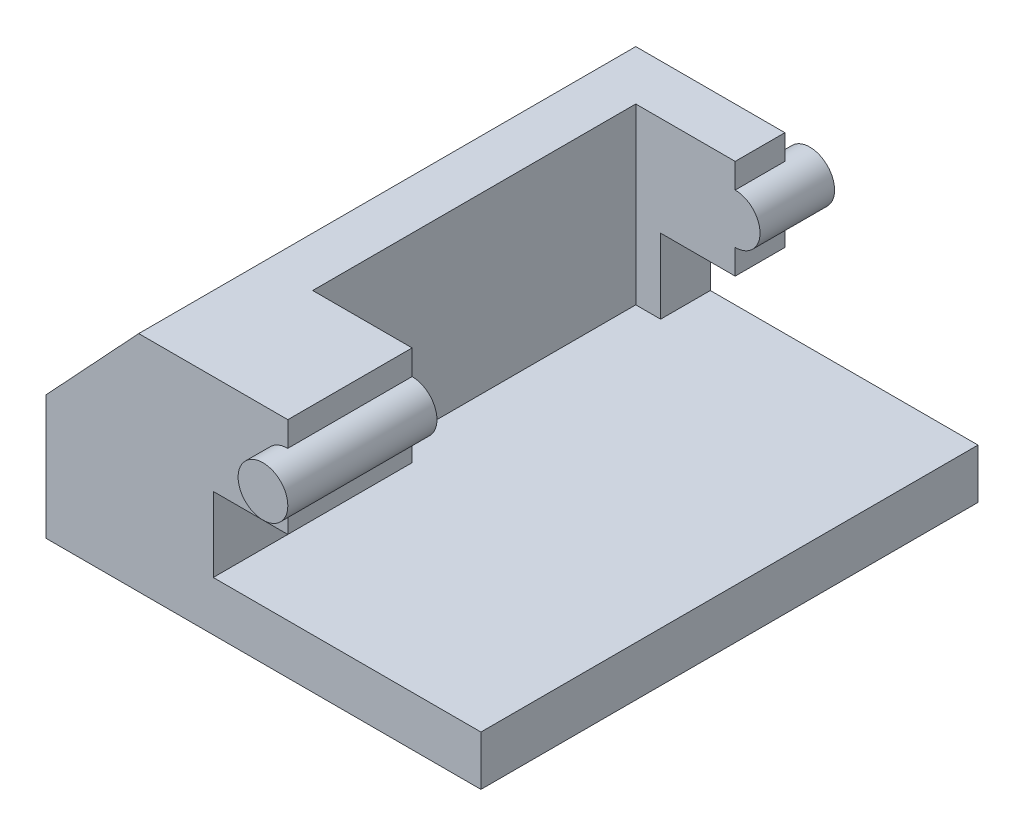
ISO-10303-21;
HEADER;
FILE_DESCRIPTION(('STEP AP214'),'2;1');
FILE_NAME('part.step','',(''),(''),'','','');
FILE_SCHEMA(('AUTOMOTIVE_DESIGN { 1 0 10303 214 1 1 1 1 }'));
ENDSEC;
DATA;
#1=APPLICATION_CONTEXT('core data for automotive mechanical design processes');
#2=APPLICATION_PROTOCOL_DEFINITION('international standard','automotive_design',2000,#1);
#3=PRODUCT_CONTEXT('',#1,'mechanical');
#4=PRODUCT('Part','Part','',(#3));
#5=PRODUCT_RELATED_PRODUCT_CATEGORY('part','',(#4));
#6=PRODUCT_DEFINITION_FORMATION('','',#4);
#7=PRODUCT_DEFINITION_CONTEXT('part definition',#1,'design');
#8=PRODUCT_DEFINITION('design','',#6,#7);
#9=PRODUCT_DEFINITION_SHAPE('','',#8);
#10=(LENGTH_UNIT() NAMED_UNIT(*) SI_UNIT(.MILLI.,.METRE.));
#11=(NAMED_UNIT(*) PLANE_ANGLE_UNIT() SI_UNIT($,.RADIAN.));
#12=(NAMED_UNIT(*) SI_UNIT($,.STERADIAN.) SOLID_ANGLE_UNIT());
#13=UNCERTAINTY_MEASURE_WITH_UNIT(LENGTH_MEASURE(1.E-05),#10,'distance_accuracy_value','');
#14=(GEOMETRIC_REPRESENTATION_CONTEXT(3) GLOBAL_UNCERTAINTY_ASSIGNED_CONTEXT((#13)) GLOBAL_UNIT_ASSIGNED_CONTEXT((#10,
#11,#12)) REPRESENTATION_CONTEXT('',''));
#15=CARTESIAN_POINT('',(0.,0.,0.));
#16=DIRECTION('',(0.,0.,1.));
#17=DIRECTION('',(1.,0.,0.));
#18=AXIS2_PLACEMENT_3D('',#15,#16,#17);
#19=CARTESIAN_POINT('',(-38.8496982772467,35.,50.));
#20=DIRECTION('',(0.,0.,-1.));
#21=DIRECTION('',(-1.,0.,0.));
#22=AXIS2_PLACEMENT_3D('',#19,#20,#21);
#23=CYLINDRICAL_SURFACE('',#22,5.);
#24=CARTESIAN_POINT('',(-38.8496982772467,35.,-55.));
#25=DIRECTION('',(0.,0.,-1.));
#26=DIRECTION('',(-1.,0.,0.));
#27=AXIS2_PLACEMENT_3D('',#24,#25,#26);
#28=CIRCLE('',#27,5.);
#29=CARTESIAN_POINT('',(-43.8496982772467,35.,-55.));
#30=VERTEX_POINT('',#29);
#31=EDGE_CURVE('E249',#30,#30,#28,.T.);
#32=ORIENTED_EDGE('',*,*,#31,.F.);
#33=EDGE_LOOP('',(#32));
#34=FACE_BOUND('',#33,.T.);
#35=CARTESIAN_POINT('',(-38.8496982772467,35.,-40.));
#36=DIRECTION('',(0.,0.,1.));
#37=DIRECTION('',(1.,0.,0.));
#38=AXIS2_PLACEMENT_3D('',#35,#36,#37);
#39=CIRCLE('',#38,5.);
#40=CARTESIAN_POINT('',(-38.8496982772467,30.,-40.));
#41=VERTEX_POINT('',#40);
#42=CARTESIAN_POINT('',(-38.8496982772467,40.,-40.));
#43=VERTEX_POINT('',#42);
#44=EDGE_CURVE('E339',#41,#43,#39,.T.);
#45=ORIENTED_EDGE('',*,*,#44,.F.);
#46=DIRECTION('',(0.,0.,-1.));
#47=VECTOR('',#46,1.);
#48=CARTESIAN_POINT('',(-38.8496982772467,30.,50.));
#49=LINE('',#48,#47);
#50=CARTESIAN_POINT('',(-38.8496982772467,30.,-50.));
#51=VERTEX_POINT('',#50);
#52=EDGE_CURVE('E106',#41,#51,#49,.T.);
#53=ORIENTED_EDGE('',*,*,#52,.T.);
#54=CARTESIAN_POINT('',(-38.8496982772467,35.,-50.));
#55=DIRECTION('',(0.,0.,-1.));
#56=DIRECTION('',(-1.,0.,0.));
#57=AXIS2_PLACEMENT_3D('',#54,#55,#56);
#58=CIRCLE('',#57,5.);
#59=CARTESIAN_POINT('',(-38.8496982772467,40.,-50.));
#60=VERTEX_POINT('',#59);
#61=EDGE_CURVE('E226',#51,#60,#58,.T.);
#62=ORIENTED_EDGE('',*,*,#61,.T.);
#63=DIRECTION('',(0.,0.,-1.));
#64=VECTOR('',#63,1.);
#65=CARTESIAN_POINT('',(-38.8496982772467,40.,50.));
#66=LINE('',#65,#64);
#67=EDGE_CURVE('E222',#43,#60,#66,.T.);
#68=ORIENTED_EDGE('',*,*,#67,.F.);
#69=EDGE_LOOP('',(#45,#53,#62,#68));
#70=FACE_BOUND('',#69,.T.);
#71=ADVANCED_FACE('F41',(#34,#70),#23,.T.);
#72=CARTESIAN_POINT('',(-38.8496982772467,0.,50.));
#73=DIRECTION('',(1.,0.,0.));
#74=DIRECTION('',(0.,0.,-1.));
#75=AXIS2_PLACEMENT_3D('',#72,#73,#74);
#76=PLANE('',#75);
#77=DIRECTION('',(0.,0.,-1.));
#78=VECTOR('',#77,1.);
#79=CARTESIAN_POINT('',(-38.8496982772467,45.,50.));
#80=LINE('',#79,#78);
#81=CARTESIAN_POINT('',(-38.8496982772467,45.,-40.));
#82=VERTEX_POINT('',#81);
#83=CARTESIAN_POINT('',(-38.8496982772467,45.,-50.));
#84=VERTEX_POINT('',#83);
#85=EDGE_CURVE('E220',#82,#84,#80,.T.);
#86=ORIENTED_EDGE('',*,*,#85,.F.);
#87=DIRECTION('',(0.,-1.,0.));
#88=VECTOR('',#87,1.);
#89=CARTESIAN_POINT('',(-38.8496982772467,0.,-40.));
#90=LINE('',#89,#88);
#91=EDGE_CURVE('E342',#82,#43,#90,.T.);
#92=ORIENTED_EDGE('',*,*,#91,.T.);
#93=ORIENTED_EDGE('',*,*,#67,.T.);
#94=DIRECTION('',(0.,-1.,0.));
#95=VECTOR('',#94,1.);
#96=CARTESIAN_POINT('',(-38.8496982772467,0.,-50.));
#97=LINE('',#96,#95);
#98=EDGE_CURVE('E173',#84,#60,#97,.T.);
#99=ORIENTED_EDGE('',*,*,#98,.F.);
#100=EDGE_LOOP('',(#86,#92,#93,#99));
#101=FACE_BOUND('',#100,.T.);
#102=ADVANCED_FACE('F372',(#101),#76,.T.);
#103=CARTESIAN_POINT('',(-53.8496982772467,0.,50.));
#104=DIRECTION('',(1.,0.,0.));
#105=DIRECTION('',(0.,0.,-1.));
#106=AXIS2_PLACEMENT_3D('',#103,#104,#105);
#107=PLANE('',#106);
#108=DIRECTION('',(0.,0.,-1.));
#109=VECTOR('',#108,1.);
#110=CARTESIAN_POINT('',(-53.8496982772467,25.,50.));
#111=LINE('',#110,#109);
#112=CARTESIAN_POINT('',(-53.8496982772467,25.,-40.));
#113=VERTEX_POINT('',#112);
#114=CARTESIAN_POINT('',(-53.8496982772467,25.,-50.));
#115=VERTEX_POINT('',#114);
#116=EDGE_CURVE('E153',#113,#115,#111,.T.);
#117=ORIENTED_EDGE('',*,*,#116,.F.);
#118=DIRECTION('',(0.,-1.,0.));
#119=VECTOR('',#118,1.);
#120=CARTESIAN_POINT('',(-53.8496982772467,0.,-40.));
#121=LINE('',#120,#119);
#122=CARTESIAN_POINT('',(-53.8496982772467,10.,-40.));
#123=VERTEX_POINT('',#122);
#124=EDGE_CURVE('E337',#113,#123,#121,.T.);
#125=ORIENTED_EDGE('',*,*,#124,.T.);
#126=DIRECTION('',(0.,0.,-1.));
#127=VECTOR('',#126,1.);
#128=CARTESIAN_POINT('',(-53.8496982772467,10.,50.));
#129=LINE('',#128,#127);
#130=CARTESIAN_POINT('',(-53.8496982772467,10.,-50.));
#131=VERTEX_POINT('',#130);
#132=EDGE_CURVE('E152',#123,#131,#129,.T.);
#133=ORIENTED_EDGE('',*,*,#132,.T.);
#134=DIRECTION('',(0.,-1.,0.));
#135=VECTOR('',#134,1.);
#136=CARTESIAN_POINT('',(-53.8496982772467,0.,-50.));
#137=LINE('',#136,#135);
#138=EDGE_CURVE('E195',#115,#131,#137,.T.);
#139=ORIENTED_EDGE('',*,*,#138,.F.);
#140=EDGE_LOOP('',(#117,#125,#133,#139));
#141=FACE_BOUND('',#140,.T.);
#142=ADVANCED_FACE('F336',(#141),#107,.T.);
#143=CARTESIAN_POINT('',(0.,25.,50.));
#144=DIRECTION('',(0.,-1.,0.));
#145=DIRECTION('',(1.,0.,0.));
#146=AXIS2_PLACEMENT_3D('',#143,#144,#145);
#147=PLANE('',#146);
#148=DIRECTION('',(0.,0.,-1.));
#149=VECTOR('',#148,1.);
#150=CARTESIAN_POINT('',(-38.8496982772467,25.,50.));
#151=LINE('',#150,#149);
#152=CARTESIAN_POINT('',(-38.8496982772467,25.,-40.));
#153=VERTEX_POINT('',#152);
#154=CARTESIAN_POINT('',(-38.8496982772467,25.,-50.));
#155=VERTEX_POINT('',#154);
#156=EDGE_CURVE('E206',#153,#155,#151,.T.);
#157=ORIENTED_EDGE('',*,*,#156,.F.);
#158=DIRECTION('',(-1.,0.,0.));
#159=VECTOR('',#158,1.);
#160=CARTESIAN_POINT('',(0.,25.,-40.));
#161=LINE('',#160,#159);
#162=EDGE_CURVE('E56',#153,#113,#161,.T.);
#163=ORIENTED_EDGE('',*,*,#162,.T.);
#164=ORIENTED_EDGE('',*,*,#116,.T.);
#165=DIRECTION('',(-1.,0.,0.));
#166=VECTOR('',#165,1.);
#167=CARTESIAN_POINT('',(0.,25.,-50.));
#168=LINE('',#167,#166);
#169=EDGE_CURVE('E198',#155,#115,#168,.T.);
#170=ORIENTED_EDGE('',*,*,#169,.F.);
#171=EDGE_LOOP('',(#157,#163,#164,#170));
#172=FACE_BOUND('',#171,.T.);
#173=ADVANCED_FACE('F362',(#172),#147,.T.);
#174=CARTESIAN_POINT('',(-38.8496982772467,0.,50.));
#175=DIRECTION('',(1.,0.,0.));
#176=DIRECTION('',(0.,0.,-1.));
#177=AXIS2_PLACEMENT_3D('',#174,#175,#176);
#178=PLANE('',#177);
#179=ORIENTED_EDGE('',*,*,#52,.F.);
#180=DIRECTION('',(0.,-1.,0.));
#181=VECTOR('',#180,1.);
#182=CARTESIAN_POINT('',(-38.8496982772467,0.,-40.));
#183=LINE('',#182,#181);
#184=EDGE_CURVE('E227',#41,#153,#183,.T.);
#185=ORIENTED_EDGE('',*,*,#184,.T.);
#186=ORIENTED_EDGE('',*,*,#156,.T.);
#187=DIRECTION('',(0.,-1.,0.));
#188=VECTOR('',#187,1.);
#189=CARTESIAN_POINT('',(-38.8496982772467,0.,-50.));
#190=LINE('',#189,#188);
#191=EDGE_CURVE('E201',#51,#155,#190,.T.);
#192=ORIENTED_EDGE('',*,*,#191,.F.);
#193=EDGE_LOOP('',(#179,#185,#186,#192));
#194=FACE_BOUND('',#193,.T.);
#195=ADVANCED_FACE('F358',(#194),#178,.T.);
#196=CARTESIAN_POINT('',(-38.8496982772467,30.,50.));
#197=VERTEX_POINT('',#196);
#198=CARTESIAN_POINT('',(-38.8496982772467,30.,25.));
#199=VERTEX_POINT('',#198);
#200=EDGE_CURVE('E65',#197,#199,#49,.T.);
#201=ORIENTED_EDGE('',*,*,#200,.T.);
#202=CARTESIAN_POINT('',(-38.8496982772467,35.,25.));
#203=DIRECTION('',(0.,0.,1.));
#204=DIRECTION('',(1.,0.,0.));
#205=AXIS2_PLACEMENT_3D('',#202,#203,#204);
#206=CIRCLE('',#205,5.);
#207=CARTESIAN_POINT('',(-38.8496982772467,40.,25.));
#208=VERTEX_POINT('',#207);
#209=EDGE_CURVE('E239',#199,#208,#206,.T.);
#210=ORIENTED_EDGE('',*,*,#209,.T.);
#211=CARTESIAN_POINT('',(-38.8496982772467,40.,50.));
#212=VERTEX_POINT('',#211);
#213=EDGE_CURVE('E223',#212,#208,#66,.T.);
#214=ORIENTED_EDGE('',*,*,#213,.F.);
#215=CARTESIAN_POINT('',(-38.8496982772467,35.,50.));
#216=DIRECTION('',(0.,0.,1.));
#217=DIRECTION('',(1.,0.,0.));
#218=AXIS2_PLACEMENT_3D('',#215,#216,#217);
#219=CIRCLE('',#218,5.);
#220=EDGE_CURVE('E245',#212,#197,#219,.T.);
#221=ORIENTED_EDGE('',*,*,#220,.T.);
#222=EDGE_LOOP('',(#201,#210,#214,#221));
#223=FACE_BOUND('',#222,.T.);
#224=CARTESIAN_POINT('',(-38.8496982772467,35.,55.));
#225=DIRECTION('',(0.,0.,1.));
#226=DIRECTION('',(1.,0.,0.));
#227=AXIS2_PLACEMENT_3D('',#224,#225,#226);
#228=CIRCLE('',#227,5.);
#229=CARTESIAN_POINT('',(-33.8496982772467,35.,55.));
#230=VERTEX_POINT('',#229);
#231=EDGE_CURVE('E177',#230,#230,#228,.T.);
#232=ORIENTED_EDGE('',*,*,#231,.F.);
#233=EDGE_LOOP('',(#232));
#234=FACE_BOUND('',#233,.T.);
#235=ADVANCED_FACE('F43',(#223,#234),#23,.T.);
#236=DIRECTION('',(0.,-1.,0.));
#237=VECTOR('',#236,1.);
#238=CARTESIAN_POINT('',(-38.8496982772467,0.,25.));
#239=LINE('',#238,#237);
#240=CARTESIAN_POINT('',(-38.8496982772467,45.,25.));
#241=VERTEX_POINT('',#240);
#242=EDGE_CURVE('E353',#241,#208,#239,.T.);
#243=ORIENTED_EDGE('',*,*,#242,.F.);
#244=CARTESIAN_POINT('',(-38.8496982772467,45.,50.));
#245=VERTEX_POINT('',#244);
#246=EDGE_CURVE('E115',#245,#241,#80,.T.);
#247=ORIENTED_EDGE('',*,*,#246,.F.);
#248=DIRECTION('',(0.,-1.,0.));
#249=VECTOR('',#248,1.);
#250=CARTESIAN_POINT('',(-38.8496982772467,0.,50.));
#251=LINE('',#250,#249);
#252=EDGE_CURVE('E204',#245,#212,#251,.T.);
#253=ORIENTED_EDGE('',*,*,#252,.T.);
#254=ORIENTED_EDGE('',*,*,#213,.T.);
#255=EDGE_LOOP('',(#243,#247,#253,#254));
#256=FACE_BOUND('',#255,.T.);
#257=ADVANCED_FACE('F300',(#256),#76,.T.);
#258=CARTESIAN_POINT('',(0.,45.,50.));
#259=DIRECTION('',(0.,1.,0.));
#260=DIRECTION('',(-1.,0.,0.));
#261=AXIS2_PLACEMENT_3D('',#258,#259,#260);
#262=PLANE('',#261);
#263=DIRECTION('',(1.,0.,0.));
#264=VECTOR('',#263,1.);
#265=CARTESIAN_POINT('',(0.,45.,25.));
#266=LINE('',#265,#264);
#267=CARTESIAN_POINT('',(-58.8496982772467,45.,25.));
#268=VERTEX_POINT('',#267);
#269=EDGE_CURVE('E254',#268,#241,#266,.T.);
#270=ORIENTED_EDGE('',*,*,#269,.F.);
#271=DIRECTION('',(0.,0.,-1.));
#272=VECTOR('',#271,1.);
#273=CARTESIAN_POINT('',(-58.8496982772467,45.,50.));
#274=LINE('',#273,#272);
#275=CARTESIAN_POINT('',(-58.8496982772467,45.,-40.));
#276=VERTEX_POINT('',#275);
#277=EDGE_CURVE('E12',#268,#276,#274,.T.);
#278=ORIENTED_EDGE('',*,*,#277,.T.);
#279=DIRECTION('',(1.,0.,0.));
#280=VECTOR('',#279,1.);
#281=CARTESIAN_POINT('',(0.,45.,-40.));
#282=LINE('',#281,#280);
#283=EDGE_CURVE('E241',#276,#82,#282,.T.);
#284=ORIENTED_EDGE('',*,*,#283,.T.);
#285=ORIENTED_EDGE('',*,*,#85,.T.);
#286=DIRECTION('',(1.,0.,0.));
#287=VECTOR('',#286,1.);
#288=CARTESIAN_POINT('',(0.,45.,-50.));
#289=LINE('',#288,#287);
#290=CARTESIAN_POINT('',(-68.8496982772467,45.,-50.));
#291=VERTEX_POINT('',#290);
#292=EDGE_CURVE('E176',#291,#84,#289,.T.);
#293=ORIENTED_EDGE('',*,*,#292,.F.);
#294=DIRECTION('',(0.,0.,-1.));
#295=VECTOR('',#294,1.);
#296=CARTESIAN_POINT('',(-68.8496982772467,45.,50.));
#297=LINE('',#296,#295);
#298=CARTESIAN_POINT('',(-68.8496982772467,45.,50.));
#299=VERTEX_POINT('',#298);
#300=EDGE_CURVE('E218',#299,#291,#297,.T.);
#301=ORIENTED_EDGE('',*,*,#300,.F.);
#302=DIRECTION('',(1.,0.,0.));
#303=VECTOR('',#302,1.);
#304=CARTESIAN_POINT('',(0.,45.,50.));
#305=LINE('',#304,#303);
#306=EDGE_CURVE('E259',#299,#245,#305,.T.);
#307=ORIENTED_EDGE('',*,*,#306,.T.);
#308=ORIENTED_EDGE('',*,*,#246,.T.);
#309=EDGE_LOOP('',(#270,#278,#284,#285,#293,#301,#307,#308));
#310=FACE_BOUND('',#309,.T.);
#311=ADVANCED_FACE('F305',(#310),#262,.T.);
#312=CARTESIAN_POINT('',(-59.2713963545531,55.2714712770658,50.));
#313=DIRECTION('',(-0.731353701619169,0.6819983600625,0.));
#314=DIRECTION('',(-0.6819983600625,-0.731353701619169,0.));
#315=AXIS2_PLACEMENT_3D('',#312,#313,#314);
#316=PLANE('',#315);
#317=DIRECTION('',(0.6819983600625,0.731353701619169,0.));
#318=VECTOR('',#317,1.);
#319=CARTESIAN_POINT('',(-59.2713963545531,55.2714712770658,-50.));
#320=LINE('',#319,#318);
#321=CARTESIAN_POINT('',(-87.5,25.,-50.));
#322=VERTEX_POINT('',#321);
#323=EDGE_CURVE('E180',#322,#291,#320,.T.);
#324=ORIENTED_EDGE('',*,*,#323,.F.);
#325=DIRECTION('',(0.,0.,-1.));
#326=VECTOR('',#325,1.);
#327=CARTESIAN_POINT('',(-87.5,25.,50.));
#328=LINE('',#327,#326);
#329=CARTESIAN_POINT('',(-87.5,25.,50.));
#330=VERTEX_POINT('',#329);
#331=EDGE_CURVE('E216',#330,#322,#328,.T.);
#332=ORIENTED_EDGE('',*,*,#331,.F.);
#333=DIRECTION('',(0.6819983600625,0.731353701619169,0.));
#334=VECTOR('',#333,1.);
#335=CARTESIAN_POINT('',(-59.2713963545531,55.2714712770658,50.));
#336=LINE('',#335,#334);
#337=EDGE_CURVE('E262',#330,#299,#336,.T.);
#338=ORIENTED_EDGE('',*,*,#337,.T.);
#339=ORIENTED_EDGE('',*,*,#300,.T.);
#340=EDGE_LOOP('',(#324,#332,#338,#339));
#341=FACE_BOUND('',#340,.T.);
#342=ADVANCED_FACE('F309',(#341),#316,.T.);
#343=CARTESIAN_POINT('',(-87.5,0.,50.));
#344=DIRECTION('',(-1.,0.,0.));
#345=DIRECTION('',(0.,0.,1.));
#346=AXIS2_PLACEMENT_3D('',#343,#344,#345);
#347=PLANE('',#346);
#348=DIRECTION('',(0.,1.,0.));
#349=VECTOR('',#348,1.);
#350=CARTESIAN_POINT('',(-87.5,0.,-50.));
#351=LINE('',#350,#349);
#352=CARTESIAN_POINT('',(-87.5,0.,-50.));
#353=VERTEX_POINT('',#352);
#354=EDGE_CURVE('E183',#353,#322,#351,.T.);
#355=ORIENTED_EDGE('',*,*,#354,.F.);
#356=DIRECTION('',(0.,0.,-1.));
#357=VECTOR('',#356,1.);
#358=CARTESIAN_POINT('',(-87.5,0.,50.));
#359=LINE('',#358,#357);
#360=CARTESIAN_POINT('',(-87.5,0.,50.));
#361=VERTEX_POINT('',#360);
#362=EDGE_CURVE('E214',#361,#353,#359,.T.);
#363=ORIENTED_EDGE('',*,*,#362,.F.);
#364=DIRECTION('',(0.,1.,0.));
#365=VECTOR('',#364,1.);
#366=CARTESIAN_POINT('',(-87.5,0.,50.));
#367=LINE('',#366,#365);
#368=EDGE_CURVE('E265',#361,#330,#367,.T.);
#369=ORIENTED_EDGE('',*,*,#368,.T.);
#370=ORIENTED_EDGE('',*,*,#331,.T.);
#371=EDGE_LOOP('',(#355,#363,#369,#370));
#372=FACE_BOUND('',#371,.T.);
#373=ADVANCED_FACE('F314',(#372),#347,.T.);
#374=CARTESIAN_POINT('',(0.,0.,50.));
#375=DIRECTION('',(0.,-1.,0.));
#376=DIRECTION('',(1.,0.,0.));
#377=AXIS2_PLACEMENT_3D('',#374,#375,#376);
#378=PLANE('',#377);
#379=DIRECTION('',(-1.,0.,0.));
#380=VECTOR('',#379,1.);
#381=CARTESIAN_POINT('',(0.,0.,-50.));
#382=LINE('',#381,#380);
#383=CARTESIAN_POINT('',(0.,0.,-50.));
#384=VERTEX_POINT('',#383);
#385=EDGE_CURVE('E186',#384,#353,#382,.T.);
#386=ORIENTED_EDGE('',*,*,#385,.F.);
#387=DIRECTION('',(0.,0.,-1.));
#388=VECTOR('',#387,1.);
#389=CARTESIAN_POINT('',(0.,0.,50.));
#390=LINE('',#389,#388);
#391=CARTESIAN_POINT('',(0.,0.,50.));
#392=VERTEX_POINT('',#391);
#393=EDGE_CURVE('E212',#392,#384,#390,.T.);
#394=ORIENTED_EDGE('',*,*,#393,.F.);
#395=DIRECTION('',(-1.,0.,0.));
#396=VECTOR('',#395,1.);
#397=CARTESIAN_POINT('',(0.,0.,50.));
#398=LINE('',#397,#396);
#399=EDGE_CURVE('E268',#392,#361,#398,.T.);
#400=ORIENTED_EDGE('',*,*,#399,.T.);
#401=ORIENTED_EDGE('',*,*,#362,.T.);
#402=EDGE_LOOP('',(#386,#394,#400,#401));
#403=FACE_BOUND('',#402,.T.);
#404=ADVANCED_FACE('F317',(#403),#378,.T.);
#405=CARTESIAN_POINT('',(0.,0.,50.));
#406=DIRECTION('',(1.,0.,0.));
#407=DIRECTION('',(0.,1.,0.));
#408=AXIS2_PLACEMENT_3D('',#405,#406,#407);
#409=PLANE('',#408);
#410=DIRECTION('',(0.,-1.,0.));
#411=VECTOR('',#410,1.);
#412=CARTESIAN_POINT('',(0.,0.,-50.));
#413=LINE('',#412,#411);
#414=CARTESIAN_POINT('',(0.,10.,-50.));
#415=VERTEX_POINT('',#414);
#416=EDGE_CURVE('E189',#415,#384,#413,.T.);
#417=ORIENTED_EDGE('',*,*,#416,.F.);
#418=DIRECTION('',(0.,0.,-1.));
#419=VECTOR('',#418,1.);
#420=CARTESIAN_POINT('',(0.,10.,50.));
#421=LINE('',#420,#419);
#422=CARTESIAN_POINT('',(0.,10.,50.));
#423=VERTEX_POINT('',#422);
#424=EDGE_CURVE('E210',#423,#415,#421,.T.);
#425=ORIENTED_EDGE('',*,*,#424,.F.);
#426=DIRECTION('',(0.,-1.,0.));
#427=VECTOR('',#426,1.);
#428=CARTESIAN_POINT('',(0.,0.,50.));
#429=LINE('',#428,#427);
#430=EDGE_CURVE('E271',#423,#392,#429,.T.);
#431=ORIENTED_EDGE('',*,*,#430,.T.);
#432=ORIENTED_EDGE('',*,*,#393,.T.);
#433=EDGE_LOOP('',(#417,#425,#431,#432));
#434=FACE_BOUND('',#433,.T.);
#435=ADVANCED_FACE('F319',(#434),#409,.T.);
#436=CARTESIAN_POINT('',(0.,10.,50.));
#437=DIRECTION('',(0.,1.,0.));
#438=DIRECTION('',(0.,0.,1.));
#439=AXIS2_PLACEMENT_3D('',#436,#437,#438);
#440=PLANE('',#439);
#441=ORIENTED_EDGE('',*,*,#424,.T.);
#442=DIRECTION('',(1.,0.,0.));
#443=VECTOR('',#442,1.);
#444=CARTESIAN_POINT('',(0.,10.,-50.));
#445=LINE('',#444,#443);
#446=EDGE_CURVE('E192',#131,#415,#445,.T.);
#447=ORIENTED_EDGE('',*,*,#446,.F.);
#448=ORIENTED_EDGE('',*,*,#132,.F.);
#449=DIRECTION('',(-1.,0.,0.));
#450=VECTOR('',#449,1.);
#451=CARTESIAN_POINT('',(-58.8496982772467,10.,-40.));
#452=LINE('',#451,#450);
#453=CARTESIAN_POINT('',(-58.8496982772467,10.,-40.));
#454=VERTEX_POINT('',#453);
#455=EDGE_CURVE('E328',#123,#454,#452,.T.);
#456=ORIENTED_EDGE('',*,*,#455,.T.);
#457=DIRECTION('',(0.,0.,-1.));
#458=VECTOR('',#457,1.);
#459=CARTESIAN_POINT('',(-58.8496982772467,10.,25.));
#460=LINE('',#459,#458);
#461=CARTESIAN_POINT('',(-58.8496982772467,10.,25.));
#462=VERTEX_POINT('',#461);
#463=EDGE_CURVE('E344',#462,#454,#460,.T.);
#464=ORIENTED_EDGE('',*,*,#463,.F.);
#465=DIRECTION('',(1.,0.,0.));
#466=VECTOR('',#465,1.);
#467=CARTESIAN_POINT('',(-58.8496982772467,10.,25.));
#468=LINE('',#467,#466);
#469=CARTESIAN_POINT('',(-53.8496982772467,10.,25.));
#470=VERTEX_POINT('',#469);
#471=EDGE_CURVE('E281',#462,#470,#468,.T.);
#472=ORIENTED_EDGE('',*,*,#471,.T.);
#473=CARTESIAN_POINT('',(-53.8496982772467,10.,50.));
#474=VERTEX_POINT('',#473);
#475=EDGE_CURVE('E208',#474,#470,#129,.T.);
#476=ORIENTED_EDGE('',*,*,#475,.F.);
#477=DIRECTION('',(1.,0.,0.));
#478=VECTOR('',#477,1.);
#479=CARTESIAN_POINT('',(0.,10.,50.));
#480=LINE('',#479,#478);
#481=EDGE_CURVE('E163',#474,#423,#480,.T.);
#482=ORIENTED_EDGE('',*,*,#481,.T.);
#483=EDGE_LOOP('',(#441,#447,#448,#456,#464,#472,#476,#482));
#484=FACE_BOUND('',#483,.T.);
#485=ADVANCED_FACE('F274',(#484),#440,.T.);
#486=DIRECTION('',(0.,-1.,0.));
#487=VECTOR('',#486,1.);
#488=CARTESIAN_POINT('',(-53.8496982772467,0.,25.));
#489=LINE('',#488,#487);
#490=CARTESIAN_POINT('',(-53.8496982772467,25.,25.));
#491=VERTEX_POINT('',#490);
#492=EDGE_CURVE('E148',#491,#470,#489,.T.);
#493=ORIENTED_EDGE('',*,*,#492,.F.);
#494=CARTESIAN_POINT('',(-53.8496982772467,25.,50.));
#495=VERTEX_POINT('',#494);
#496=EDGE_CURVE('E141',#495,#491,#111,.T.);
#497=ORIENTED_EDGE('',*,*,#496,.F.);
#498=DIRECTION('',(0.,-1.,0.));
#499=VECTOR('',#498,1.);
#500=CARTESIAN_POINT('',(-53.8496982772467,0.,50.));
#501=LINE('',#500,#499);
#502=EDGE_CURVE('E145',#495,#474,#501,.T.);
#503=ORIENTED_EDGE('',*,*,#502,.T.);
#504=ORIENTED_EDGE('',*,*,#475,.T.);
#505=EDGE_LOOP('',(#493,#497,#503,#504));
#506=FACE_BOUND('',#505,.T.);
#507=ADVANCED_FACE('F143',(#506),#107,.T.);
#508=DIRECTION('',(-1.,0.,0.));
#509=VECTOR('',#508,1.);
#510=CARTESIAN_POINT('',(0.,25.,25.));
#511=LINE('',#510,#509);
#512=CARTESIAN_POINT('',(-38.8496982772467,25.,25.));
#513=VERTEX_POINT('',#512);
#514=EDGE_CURVE('E235',#513,#491,#511,.T.);
#515=ORIENTED_EDGE('',*,*,#514,.F.);
#516=CARTESIAN_POINT('',(-38.8496982772467,25.,50.));
#517=VERTEX_POINT('',#516);
#518=EDGE_CURVE('E167',#517,#513,#151,.T.);
#519=ORIENTED_EDGE('',*,*,#518,.F.);
#520=DIRECTION('',(-1.,0.,0.));
#521=VECTOR('',#520,1.);
#522=CARTESIAN_POINT('',(0.,25.,50.));
#523=LINE('',#522,#521);
#524=EDGE_CURVE('E160',#517,#495,#523,.T.);
#525=ORIENTED_EDGE('',*,*,#524,.T.);
#526=ORIENTED_EDGE('',*,*,#496,.T.);
#527=EDGE_LOOP('',(#515,#519,#525,#526));
#528=FACE_BOUND('',#527,.T.);
#529=ADVANCED_FACE('F165',(#528),#147,.T.);
#530=DIRECTION('',(0.,-1.,0.));
#531=VECTOR('',#530,1.);
#532=CARTESIAN_POINT('',(-38.8496982772467,0.,25.));
#533=LINE('',#532,#531);
#534=EDGE_CURVE('E49',#199,#513,#533,.T.);
#535=ORIENTED_EDGE('',*,*,#534,.F.);
#536=ORIENTED_EDGE('',*,*,#200,.F.);
#537=DIRECTION('',(0.,-1.,0.));
#538=VECTOR('',#537,1.);
#539=CARTESIAN_POINT('',(-38.8496982772467,0.,50.));
#540=LINE('',#539,#538);
#541=EDGE_CURVE('E168',#197,#517,#540,.T.);
#542=ORIENTED_EDGE('',*,*,#541,.T.);
#543=ORIENTED_EDGE('',*,*,#518,.T.);
#544=EDGE_LOOP('',(#535,#536,#542,#543));
#545=FACE_BOUND('',#544,.T.);
#546=ADVANCED_FACE('F243',(#545),#178,.T.);
#547=CARTESIAN_POINT('',(0.,0.,50.));
#548=DIRECTION('',(0.,0.,1.));
#549=DIRECTION('',(1.,0.,0.));
#550=AXIS2_PLACEMENT_3D('',#547,#548,#549);
#551=PLANE('',#550);
#552=ORIENTED_EDGE('',*,*,#220,.F.);
#553=ORIENTED_EDGE('',*,*,#252,.F.);
#554=ORIENTED_EDGE('',*,*,#306,.F.);
#555=ORIENTED_EDGE('',*,*,#337,.F.);
#556=ORIENTED_EDGE('',*,*,#368,.F.);
#557=ORIENTED_EDGE('',*,*,#399,.F.);
#558=ORIENTED_EDGE('',*,*,#430,.F.);
#559=ORIENTED_EDGE('',*,*,#481,.F.);
#560=ORIENTED_EDGE('',*,*,#502,.F.);
#561=ORIENTED_EDGE('',*,*,#524,.F.);
#562=ORIENTED_EDGE('',*,*,#541,.F.);
#563=EDGE_LOOP('',(#552,#553,#554,#555,#556,#557,#558,#559,#560,#561,#562));
#564=FACE_BOUND('',#563,.T.);
#565=ADVANCED_FACE('F159',(#564),#551,.T.);
#566=CARTESIAN_POINT('',(0.,0.,-50.));
#567=DIRECTION('',(0.,0.,1.));
#568=DIRECTION('',(1.,0.,0.));
#569=AXIS2_PLACEMENT_3D('',#566,#567,#568);
#570=PLANE('',#569);
#571=ORIENTED_EDGE('',*,*,#61,.F.);
#572=ORIENTED_EDGE('',*,*,#191,.T.);
#573=ORIENTED_EDGE('',*,*,#169,.T.);
#574=ORIENTED_EDGE('',*,*,#138,.T.);
#575=ORIENTED_EDGE('',*,*,#446,.T.);
#576=ORIENTED_EDGE('',*,*,#416,.T.);
#577=ORIENTED_EDGE('',*,*,#385,.T.);
#578=ORIENTED_EDGE('',*,*,#354,.T.);
#579=ORIENTED_EDGE('',*,*,#323,.T.);
#580=ORIENTED_EDGE('',*,*,#292,.T.);
#581=ORIENTED_EDGE('',*,*,#98,.T.);
#582=EDGE_LOOP('',(#571,#572,#573,#574,#575,#576,#577,#578,#579,#580,#581));
#583=FACE_BOUND('',#582,.T.);
#584=ADVANCED_FACE('F321',(#583),#570,.F.);
#585=CARTESIAN_POINT('',(-38.8496982772467,35.,55.));
#586=DIRECTION('',(0.,0.,1.));
#587=DIRECTION('',(1.,0.,0.));
#588=AXIS2_PLACEMENT_3D('',#585,#586,#587);
#589=PLANE('',#588);
#590=ORIENTED_EDGE('',*,*,#231,.T.);
#591=EDGE_LOOP('',(#590));
#592=FACE_BOUND('',#591,.T.);
#593=ADVANCED_FACE('F483',(#592),#589,.T.);
#594=CARTESIAN_POINT('',(-38.8496982772467,35.,-55.));
#595=DIRECTION('',(0.,0.,-1.));
#596=DIRECTION('',(-1.,0.,0.));
#597=AXIS2_PLACEMENT_3D('',#594,#595,#596);
#598=PLANE('',#597);
#599=ORIENTED_EDGE('',*,*,#31,.T.);
#600=EDGE_LOOP('',(#599));
#601=FACE_BOUND('',#600,.T.);
#602=ADVANCED_FACE('F459',(#601),#598,.T.);
#603=CARTESIAN_POINT('',(-58.8496982772467,56.5960272172654,25.));
#604=DIRECTION('',(1.,0.,0.));
#605=DIRECTION('',(0.,1.,0.));
#606=AXIS2_PLACEMENT_3D('',#603,#604,#605);
#607=PLANE('',#606);
#608=DIRECTION('',(0.,-1.,0.));
#609=VECTOR('',#608,1.);
#610=CARTESIAN_POINT('',(-58.8496982772467,56.5960272172654,25.));
#611=LINE('',#610,#609);
#612=EDGE_CURVE('E583',#268,#462,#611,.T.);
#613=ORIENTED_EDGE('',*,*,#612,.T.);
#614=ORIENTED_EDGE('',*,*,#463,.T.);
#615=DIRECTION('',(0.,1.,0.));
#616=VECTOR('',#615,1.);
#617=CARTESIAN_POINT('',(-58.8496982772467,56.5960272172654,-40.));
#618=LINE('',#617,#616);
#619=EDGE_CURVE('E589',#454,#276,#618,.T.);
#620=ORIENTED_EDGE('',*,*,#619,.T.);
#621=ORIENTED_EDGE('',*,*,#277,.F.);
#622=EDGE_LOOP('',(#613,#614,#620,#621));
#623=FACE_BOUND('',#622,.T.);
#624=ADVANCED_FACE('F454',(#623),#607,.T.);
#625=CARTESIAN_POINT('',(0.,0.,25.));
#626=DIRECTION('',(0.,0.,1.));
#627=DIRECTION('',(1.,0.,0.));
#628=AXIS2_PLACEMENT_3D('',#625,#626,#627);
#629=PLANE('',#628);
#630=ORIENTED_EDGE('',*,*,#269,.T.);
#631=ORIENTED_EDGE('',*,*,#242,.T.);
#632=ORIENTED_EDGE('',*,*,#209,.F.);
#633=ORIENTED_EDGE('',*,*,#534,.T.);
#634=ORIENTED_EDGE('',*,*,#514,.T.);
#635=ORIENTED_EDGE('',*,*,#492,.T.);
#636=ORIENTED_EDGE('',*,*,#471,.F.);
#637=ORIENTED_EDGE('',*,*,#612,.F.);
#638=EDGE_LOOP('',(#630,#631,#632,#633,#634,#635,#636,#637));
#639=FACE_BOUND('',#638,.T.);
#640=ADVANCED_FACE('F234',(#639),#629,.F.);
#641=CARTESIAN_POINT('',(0.,0.,-40.));
#642=DIRECTION('',(0.,0.,1.));
#643=DIRECTION('',(1.,0.,0.));
#644=AXIS2_PLACEMENT_3D('',#641,#642,#643);
#645=PLANE('',#644);
#646=ORIENTED_EDGE('',*,*,#619,.F.);
#647=ORIENTED_EDGE('',*,*,#455,.F.);
#648=ORIENTED_EDGE('',*,*,#124,.F.);
#649=ORIENTED_EDGE('',*,*,#162,.F.);
#650=ORIENTED_EDGE('',*,*,#184,.F.);
#651=ORIENTED_EDGE('',*,*,#44,.T.);
#652=ORIENTED_EDGE('',*,*,#91,.F.);
#653=ORIENTED_EDGE('',*,*,#283,.F.);
#654=EDGE_LOOP('',(#646,#647,#648,#649,#650,#651,#652,#653));
#655=FACE_BOUND('',#654,.T.);
#656=ADVANCED_FACE('F369',(#655),#645,.T.);
#657=CLOSED_SHELL('',(#71,#102,#142,#173,#195,#235,#257,#311,#342,#373,#404,#435,#485,#507,#529,
#546,#565,#584,#593,#602,#624,#640,#656));
#658=MANIFOLD_SOLID_BREP('B2',#657);
#659=ADVANCED_BREP_SHAPE_REPRESENTATION('',(#18,#658),#14);
#660=SHAPE_DEFINITION_REPRESENTATION(#9,#659);
ENDSEC;
END-ISO-10303-21;
